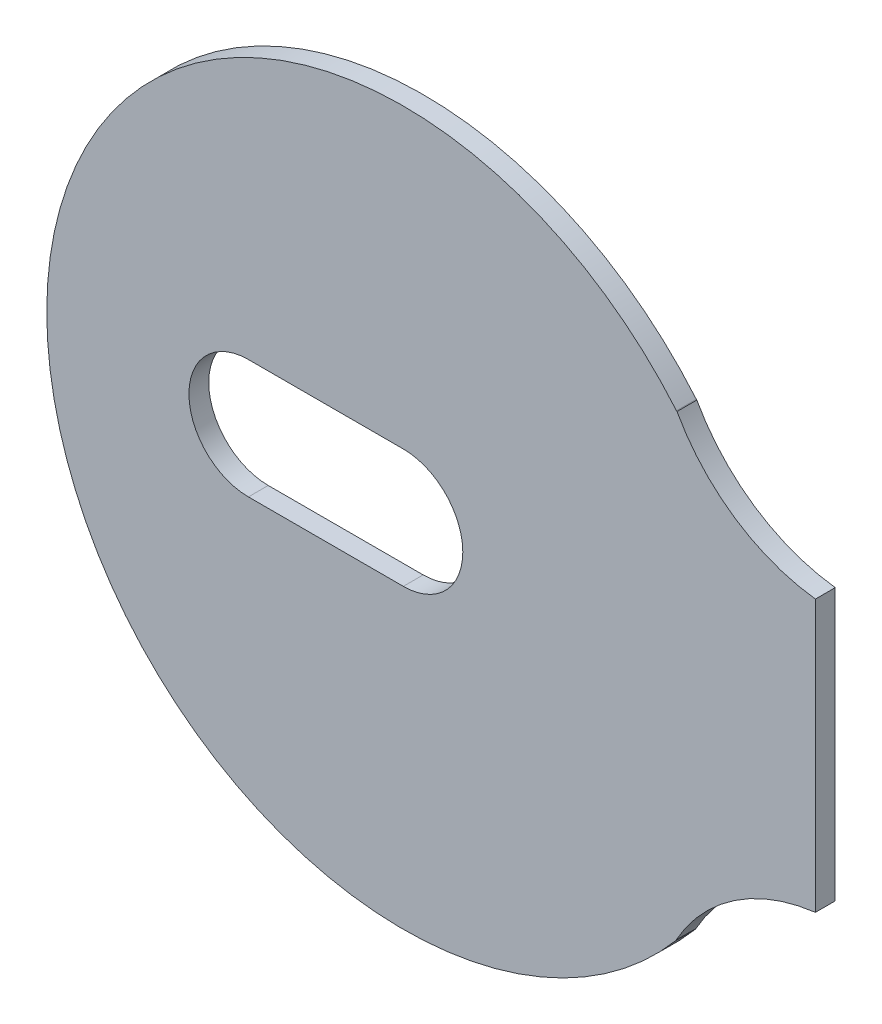
ISO-10303-21;
HEADER;
FILE_DESCRIPTION(('STEP AP214'),'2;1');
FILE_NAME('part.step','',(''),(''),'','','');
FILE_SCHEMA(('AUTOMOTIVE_DESIGN { 1 0 10303 214 1 1 1 1 }'));
ENDSEC;
DATA;
#1=APPLICATION_CONTEXT('core data for automotive mechanical design processes');
#2=APPLICATION_PROTOCOL_DEFINITION('international standard','automotive_design',2000,#1);
#3=PRODUCT_CONTEXT('',#1,'mechanical');
#4=PRODUCT('Part','Part','',(#3));
#5=PRODUCT_RELATED_PRODUCT_CATEGORY('part','',(#4));
#6=PRODUCT_DEFINITION_FORMATION('','',#4);
#7=PRODUCT_DEFINITION_CONTEXT('part definition',#1,'design');
#8=PRODUCT_DEFINITION('design','',#6,#7);
#9=PRODUCT_DEFINITION_SHAPE('','',#8);
#10=(LENGTH_UNIT() NAMED_UNIT(*) SI_UNIT(.MILLI.,.METRE.));
#11=(NAMED_UNIT(*) PLANE_ANGLE_UNIT() SI_UNIT($,.RADIAN.));
#12=(NAMED_UNIT(*) SI_UNIT($,.STERADIAN.) SOLID_ANGLE_UNIT());
#13=UNCERTAINTY_MEASURE_WITH_UNIT(LENGTH_MEASURE(1.E-05),#10,'distance_accuracy_value','');
#14=(GEOMETRIC_REPRESENTATION_CONTEXT(3) GLOBAL_UNCERTAINTY_ASSIGNED_CONTEXT((#13)) GLOBAL_UNIT_ASSIGNED_CONTEXT((#10,
#11,#12)) REPRESENTATION_CONTEXT('',''));
#15=CARTESIAN_POINT('',(0.,0.,0.));
#16=DIRECTION('',(0.,0.,1.));
#17=DIRECTION('',(1.,0.,0.));
#18=AXIS2_PLACEMENT_3D('',#15,#16,#17);
#19=CARTESIAN_POINT('',(-1.68641790286621E-06,1.48839274242687E-12,1.));
#20=DIRECTION('',(0.,0.,0.999999999999989));
#21=DIRECTION('',(0.999999999999995,0.,0.));
#22=AXIS2_PLACEMENT_3D('',#19,#20,#21);
#23=PLANE('',#22);
#24=CARTESIAN_POINT('',(-1.68641790286621E-06,1.48839274242687E-12,1.));
#25=DIRECTION('',(0.,0.,0.999999999999989));
#26=DIRECTION('',(0.999999999999995,0.,0.));
#27=AXIS2_PLACEMENT_3D('',#24,#25,#26);
#28=CIRCLE('',#27,17.9873368235399);
#29=CARTESIAN_POINT('',(13.7790977337644,11.562037241431,1.));
#30=VERTEX_POINT('',#29);
#31=CARTESIAN_POINT('',(13.756161336656,-11.5893168429399,1.));
#32=VERTEX_POINT('',#31);
#33=EDGE_CURVE('E149',#30,#32,#28,.T.);
#34=ORIENTED_EDGE('',*,*,#33,.T.);
#35=DIRECTION('',(-0.0323617704481932,0.999476220734364,0.));
#36=VECTOR('',#35,1.);
#37=CARTESIAN_POINT('',(13.756161336656,-11.5893168429399,1.));
#38=LINE('',#37,#36);
#39=CARTESIAN_POINT('',(13.75573772796,-11.5762339116699,1.));
#40=VERTEX_POINT('',#39);
#41=EDGE_CURVE('E152',#32,#40,#38,.T.);
#42=ORIENTED_EDGE('',*,*,#41,.T.);
#43=CARTESIAN_POINT('',(21.9238592590262,-16.1347771797835,0.999999999999997));
#44=DIRECTION('',(0.,0.,-0.999999999999989));
#45=DIRECTION('',(0.999999999999995,0.,0.));
#46=AXIS2_PLACEMENT_3D('',#43,#44,#45);
#47=CIRCLE('',#46,9.35406468191958);
#48=CARTESIAN_POINT('',(20.787340614677,-6.85001270002532,1.00000000000008));
#49=VERTEX_POINT('',#48);
#50=EDGE_CURVE('E155',#40,#49,#47,.T.);
#51=ORIENTED_EDGE('',*,*,#50,.T.);
#52=DIRECTION('',(0.,0.999999999999995,0.));
#53=VECTOR('',#52,1.);
#54=CARTESIAN_POINT('',(20.787340614677,-6.85001270002531,1.00000000000008));
#55=LINE('',#54,#53);
#56=CARTESIAN_POINT('',(20.787340614677,6.8387126087336,1.));
#57=VERTEX_POINT('',#56);
#58=EDGE_CURVE('E157',#49,#57,#55,.T.);
#59=ORIENTED_EDGE('',*,*,#58,.T.);
#60=CARTESIAN_POINT('',(21.8618680057291,15.9694738662407,1.));
#61=DIRECTION('',(0.,0.,-0.999999999999989));
#62=DIRECTION('',(0.999999999999995,0.,0.));
#63=AXIS2_PLACEMENT_3D('',#60,#61,#62);
#64=CIRCLE('',#63,9.19377018723637);
#65=CARTESIAN_POINT('',(13.8050997545794,11.540716071669,1.));
#66=VERTEX_POINT('',#65);
#67=EDGE_CURVE('E159',#57,#66,#64,.T.);
#68=ORIENTED_EDGE('',*,*,#67,.T.);
#69=DIRECTION('',(-0.777695902701099,0.628640662797045,0.));
#70=VECTOR('',#69,1.);
#71=CARTESIAN_POINT('',(13.8050997545794,11.540716071669,1.));
#72=LINE('',#71,#70);
#73=CARTESIAN_POINT('',(13.7808427652644,11.560323902683,1.));
#74=VERTEX_POINT('',#73);
#75=EDGE_CURVE('E161',#66,#74,#72,.T.);
#76=ORIENTED_EDGE('',*,*,#75,.T.);
#77=DIRECTION('',(-0.713556796547331,0.70059738659311,0.));
#78=VECTOR('',#77,1.);
#79=CARTESIAN_POINT('',(13.7808427652644,11.560323902683,1.));
#80=LINE('',#79,#78);
#81=EDGE_CURVE('E163',#74,#30,#80,.T.);
#82=ORIENTED_EDGE('',*,*,#81,.T.);
#83=EDGE_LOOP('',(#34,#42,#51,#59,#68,#76,#82));
#84=FACE_BOUND('',#83,.T.);
#85=DIRECTION('',(-0.999999999999995,0.,0.));
#86=VECTOR('',#85,1.);
#87=CARTESIAN_POINT('',(-7.81561595123188,3.00000508000998,1.));
#88=LINE('',#87,#86);
#89=CARTESIAN_POINT('',(0.,3.00000508000998,1.));
#90=VERTEX_POINT('',#89);
#91=CARTESIAN_POINT('',(-7.81561595123188,3.00000508000998,1.));
#92=VERTEX_POINT('',#91);
#93=EDGE_CURVE('E121',#90,#92,#88,.T.);
#94=ORIENTED_EDGE('',*,*,#93,.F.);
#95=CARTESIAN_POINT('',(1.76156528833079E-12,1.32521552325543E-08,1.));
#96=DIRECTION('',(0.,0.,0.999999999999989));
#97=DIRECTION('',(0.999999999999995,0.,0.));
#98=AXIS2_PLACEMENT_3D('',#95,#96,#97);
#99=CIRCLE('',#98,3.00000506675784);
#100=CARTESIAN_POINT('',(3.52313057666159E-12,-3.00000505350567,1.));
#101=VERTEX_POINT('',#100);
#102=EDGE_CURVE('E113',#101,#90,#99,.T.);
#103=ORIENTED_EDGE('',*,*,#102,.F.);
#104=DIRECTION('',(0.999999999999995,0.,0.));
#105=VECTOR('',#104,1.);
#106=CARTESIAN_POINT('',(3.52313057666159E-12,-3.00000505350567,1.));
#107=LINE('',#106,#105);
#108=CARTESIAN_POINT('',(-7.81561595122835,-3.00000505350567,1.));
#109=VERTEX_POINT('',#108);
#110=EDGE_CURVE('E135',#109,#101,#107,.T.);
#111=ORIENTED_EDGE('',*,*,#110,.F.);
#112=CARTESIAN_POINT('',(-7.81601473202711,1.32521550157138E-08,1.));
#113=DIRECTION('',(0.,0.,0.999999999999989));
#114=DIRECTION('',(0.999999999999995,0.,0.));
#115=AXIS2_PLACEMENT_3D('',#112,#113,#114);
#116=CIRCLE('',#115,3.00000509326215);
#117=EDGE_CURVE('E133',#92,#109,#116,.T.);
#118=ORIENTED_EDGE('',*,*,#117,.F.);
#119=EDGE_LOOP('',(#94,#103,#111,#118));
#120=FACE_BOUND('',#119,.T.);
#121=ADVANCED_FACE('F30',(#84,#120),#23,.T.);
#122=CARTESIAN_POINT('',(-1.68641790286621E-06,1.4883927423881E-12,0.));
#123=DIRECTION('',(0.,0.,0.999999999999989));
#124=DIRECTION('',(0.999999999999995,0.,0.));
#125=AXIS2_PLACEMENT_3D('',#122,#123,#124);
#126=PLANE('',#125);
#127=CARTESIAN_POINT('',(-1.68641790286621E-06,1.4883927423881E-12,0.));
#128=DIRECTION('',(0.,0.,0.999999999999989));
#129=DIRECTION('',(0.999999999999995,0.,0.));
#130=AXIS2_PLACEMENT_3D('',#127,#128,#129);
#131=CIRCLE('',#130,17.9873368235399);
#132=CARTESIAN_POINT('',(13.7790977337644,11.5620372414309,0.));
#133=VERTEX_POINT('',#132);
#134=CARTESIAN_POINT('',(13.7561613366559,-11.5893168429399,0.));
#135=VERTEX_POINT('',#134);
#136=EDGE_CURVE('E129',#133,#135,#131,.T.);
#137=ORIENTED_EDGE('',*,*,#136,.F.);
#138=DIRECTION('',(-0.713556796547331,0.70059738659311,0.));
#139=VECTOR('',#138,1.);
#140=CARTESIAN_POINT('',(13.7808427652644,11.5603239026829,0.));
#141=LINE('',#140,#139);
#142=CARTESIAN_POINT('',(13.7808427652644,11.5603239026829,0.));
#143=VERTEX_POINT('',#142);
#144=EDGE_CURVE('E153',#143,#133,#141,.T.);
#145=ORIENTED_EDGE('',*,*,#144,.F.);
#146=DIRECTION('',(-0.777695902701099,0.628640662797045,0.));
#147=VECTOR('',#146,1.);
#148=CARTESIAN_POINT('',(13.8050997545794,11.5407160716689,0.));
#149=LINE('',#148,#147);
#150=CARTESIAN_POINT('',(13.8050997545794,11.5407160716689,0.));
#151=VERTEX_POINT('',#150);
#152=EDGE_CURVE('E176',#151,#143,#149,.T.);
#153=ORIENTED_EDGE('',*,*,#152,.F.);
#154=CARTESIAN_POINT('',(21.8618680057291,15.9694738662407,0.));
#155=DIRECTION('',(0.,0.,-0.999999999999989));
#156=DIRECTION('',(0.999999999999995,0.,0.));
#157=AXIS2_PLACEMENT_3D('',#154,#155,#156);
#158=CIRCLE('',#157,9.19377018723637);
#159=CARTESIAN_POINT('',(20.787340614677,6.8387126087336,0.));
#160=VERTEX_POINT('',#159);
#161=EDGE_CURVE('E174',#160,#151,#158,.T.);
#162=ORIENTED_EDGE('',*,*,#161,.F.);
#163=DIRECTION('',(0.,0.999999999999995,0.));
#164=VECTOR('',#163,1.);
#165=CARTESIAN_POINT('',(20.787340614677,-6.85001270002531,0.));
#166=LINE('',#165,#164);
#167=CARTESIAN_POINT('',(20.787340614677,-6.85001270002532,0.));
#168=VERTEX_POINT('',#167);
#169=EDGE_CURVE('E172',#168,#160,#166,.T.);
#170=ORIENTED_EDGE('',*,*,#169,.F.);
#171=CARTESIAN_POINT('',(21.9238592590262,-16.1347771797835,0.));
#172=DIRECTION('',(0.,0.,-0.999999999999989));
#173=DIRECTION('',(0.999999999999995,0.,0.));
#174=AXIS2_PLACEMENT_3D('',#171,#172,#173);
#175=CIRCLE('',#174,9.35406468191958);
#176=CARTESIAN_POINT('',(13.7557377279599,-11.5762339116699,0.));
#177=VERTEX_POINT('',#176);
#178=EDGE_CURVE('E170',#177,#168,#175,.T.);
#179=ORIENTED_EDGE('',*,*,#178,.F.);
#180=DIRECTION('',(-0.0323617704481932,0.999476220734364,0.));
#181=VECTOR('',#180,1.);
#182=CARTESIAN_POINT('',(13.7561613366559,-11.5893168429399,0.));
#183=LINE('',#182,#181);
#184=EDGE_CURVE('E168',#135,#177,#183,.T.);
#185=ORIENTED_EDGE('',*,*,#184,.F.);
#186=EDGE_LOOP('',(#137,#145,#153,#162,#170,#179,#185));
#187=FACE_BOUND('',#186,.T.);
#188=CARTESIAN_POINT('',(1.7615652883308E-12,1.32521552325542E-08,0.));
#189=DIRECTION('',(0.,0.,0.999999999999989));
#190=DIRECTION('',(0.999999999999995,0.,0.));
#191=AXIS2_PLACEMENT_3D('',#188,#189,#190);
#192=CIRCLE('',#191,3.00000506675784);
#193=CARTESIAN_POINT('',(3.52313057376646E-12,-3.00000505350567,0.));
#194=VERTEX_POINT('',#193);
#195=CARTESIAN_POINT('',(0.,3.00000508000998,0.));
#196=VERTEX_POINT('',#195);
#197=EDGE_CURVE('E53',#194,#196,#192,.T.);
#198=ORIENTED_EDGE('',*,*,#197,.T.);
#199=DIRECTION('',(-0.999999999999995,0.,0.));
#200=VECTOR('',#199,1.);
#201=CARTESIAN_POINT('',(-7.81561595123192,3.00000508000998,0.));
#202=LINE('',#201,#200);
#203=CARTESIAN_POINT('',(-7.81561595123192,3.00000508000998,0.));
#204=VERTEX_POINT('',#203);
#205=EDGE_CURVE('E128',#196,#204,#202,.T.);
#206=ORIENTED_EDGE('',*,*,#205,.T.);
#207=CARTESIAN_POINT('',(-7.81601473202716,1.32521550157138E-08,0.));
#208=DIRECTION('',(0.,0.,0.999999999999989));
#209=DIRECTION('',(0.999999999999995,0.,0.));
#210=AXIS2_PLACEMENT_3D('',#207,#208,#209);
#211=CIRCLE('',#210,3.00000509326215);
#212=CARTESIAN_POINT('',(-7.81561595122839,-3.00000505350567,0.));
#213=VERTEX_POINT('',#212);
#214=EDGE_CURVE('E141',#204,#213,#211,.T.);
#215=ORIENTED_EDGE('',*,*,#214,.T.);
#216=DIRECTION('',(0.999999999999995,0.,0.));
#217=VECTOR('',#216,1.);
#218=CARTESIAN_POINT('',(3.52313057666159E-12,-3.00000505350567,0.));
#219=LINE('',#218,#217);
#220=EDGE_CURVE('E122',#213,#194,#219,.T.);
#221=ORIENTED_EDGE('',*,*,#220,.T.);
#222=EDGE_LOOP('',(#198,#206,#215,#221));
#223=FACE_BOUND('',#222,.T.);
#224=ADVANCED_FACE('F203',(#187,#223),#126,.F.);
#225=CARTESIAN_POINT('',(-1.68641790286621E-06,1.48839274242687E-12,1.));
#226=DIRECTION('',(0.,0.,-0.999999999999989));
#227=DIRECTION('',(-0.999999999999995,0.,0.));
#228=AXIS2_PLACEMENT_3D('',#225,#226,#227);
#229=CYLINDRICAL_SURFACE('',#228,17.9873368235399);
#230=ORIENTED_EDGE('',*,*,#136,.T.);
#231=DIRECTION('',(0.,0.,-0.999999999999989));
#232=VECTOR('',#231,1.);
#233=CARTESIAN_POINT('',(13.756161336656,-11.5893168429399,1.));
#234=LINE('',#233,#232);
#235=EDGE_CURVE('E11',#32,#135,#234,.T.);
#236=ORIENTED_EDGE('',*,*,#235,.F.);
#237=ORIENTED_EDGE('',*,*,#33,.F.);
#238=DIRECTION('',(0.,0.,-0.999999999999989));
#239=VECTOR('',#238,1.);
#240=CARTESIAN_POINT('',(13.7790977337644,11.562037241431,1.));
#241=LINE('',#240,#239);
#242=EDGE_CURVE('E165',#30,#133,#241,.T.);
#243=ORIENTED_EDGE('',*,*,#242,.T.);
#244=EDGE_LOOP('',(#230,#236,#237,#243));
#245=FACE_BOUND('',#244,.T.);
#246=ADVANCED_FACE('F32',(#245),#229,.T.);
#247=CARTESIAN_POINT('',(13.756161336656,-11.5893168429399,1.));
#248=DIRECTION('',(-0.999476220734364,-0.0323617704481932,0.));
#249=DIRECTION('',(0.0323617704481932,-0.999476220734364,0.));
#250=AXIS2_PLACEMENT_3D('',#247,#248,#249);
#251=PLANE('',#250);
#252=ORIENTED_EDGE('',*,*,#184,.T.);
#253=DIRECTION('',(0.,0.,-0.999999999999989));
#254=VECTOR('',#253,1.);
#255=CARTESIAN_POINT('',(13.75573772796,-11.5762339116699,1.));
#256=LINE('',#255,#254);
#257=EDGE_CURVE('E38',#40,#177,#256,.T.);
#258=ORIENTED_EDGE('',*,*,#257,.F.);
#259=ORIENTED_EDGE('',*,*,#41,.F.);
#260=ORIENTED_EDGE('',*,*,#235,.T.);
#261=EDGE_LOOP('',(#252,#258,#259,#260));
#262=FACE_BOUND('',#261,.T.);
#263=ADVANCED_FACE('F220',(#262),#251,.F.);
#264=CARTESIAN_POINT('',(21.9238592590262,-16.1347771797835,0.999999999999997));
#265=DIRECTION('',(0.,0.,-0.999999999999989));
#266=DIRECTION('',(-0.999999999999995,0.,0.));
#267=AXIS2_PLACEMENT_3D('',#264,#265,#266);
#268=CYLINDRICAL_SURFACE('',#267,9.35406468191958);
#269=ORIENTED_EDGE('',*,*,#178,.T.);
#270=DIRECTION('',(0.,0.,-0.999999999999989));
#271=VECTOR('',#270,1.);
#272=CARTESIAN_POINT('',(20.787340614677,-6.85001270002532,1.00000000000008));
#273=LINE('',#272,#271);
#274=EDGE_CURVE('E190',#49,#168,#273,.T.);
#275=ORIENTED_EDGE('',*,*,#274,.F.);
#276=ORIENTED_EDGE('',*,*,#50,.F.);
#277=ORIENTED_EDGE('',*,*,#257,.T.);
#278=EDGE_LOOP('',(#269,#275,#276,#277));
#279=FACE_BOUND('',#278,.T.);
#280=ADVANCED_FACE('F197',(#279),#268,.F.);
#281=CARTESIAN_POINT('',(20.787340614677,-6.85001270002531,1.00000000000008));
#282=DIRECTION('',(-0.999999999999995,0.,0.));
#283=DIRECTION('',(0.,0.,0.999999999999989));
#284=AXIS2_PLACEMENT_3D('',#281,#282,#283);
#285=PLANE('',#284);
#286=ORIENTED_EDGE('',*,*,#169,.T.);
#287=DIRECTION('',(0.,0.,-0.999999999999989));
#288=VECTOR('',#287,1.);
#289=CARTESIAN_POINT('',(20.787340614677,6.8387126087336,1.));
#290=LINE('',#289,#288);
#291=EDGE_CURVE('E187',#57,#160,#290,.T.);
#292=ORIENTED_EDGE('',*,*,#291,.F.);
#293=ORIENTED_EDGE('',*,*,#58,.F.);
#294=ORIENTED_EDGE('',*,*,#274,.T.);
#295=EDGE_LOOP('',(#286,#292,#293,#294));
#296=FACE_BOUND('',#295,.T.);
#297=ADVANCED_FACE('F209',(#296),#285,.F.);
#298=CARTESIAN_POINT('',(21.8618680057291,15.9694738662407,1.));
#299=DIRECTION('',(0.,0.,-0.999999999999989));
#300=DIRECTION('',(-0.999999999999995,0.,0.));
#301=AXIS2_PLACEMENT_3D('',#298,#299,#300);
#302=CYLINDRICAL_SURFACE('',#301,9.19377018723637);
#303=ORIENTED_EDGE('',*,*,#161,.T.);
#304=DIRECTION('',(0.,0.,-0.999999999999989));
#305=VECTOR('',#304,1.);
#306=CARTESIAN_POINT('',(13.8050997545794,11.540716071669,1.));
#307=LINE('',#306,#305);
#308=EDGE_CURVE('E184',#66,#151,#307,.T.);
#309=ORIENTED_EDGE('',*,*,#308,.F.);
#310=ORIENTED_EDGE('',*,*,#67,.F.);
#311=ORIENTED_EDGE('',*,*,#291,.T.);
#312=EDGE_LOOP('',(#303,#309,#310,#311));
#313=FACE_BOUND('',#312,.T.);
#314=ADVANCED_FACE('F213',(#313),#302,.F.);
#315=CARTESIAN_POINT('',(13.8050997545794,11.540716071669,1.));
#316=DIRECTION('',(-0.628640662797045,-0.777695902701099,0.));
#317=DIRECTION('',(0.777695902701099,-0.628640662797045,0.));
#318=AXIS2_PLACEMENT_3D('',#315,#316,#317);
#319=PLANE('',#318);
#320=ORIENTED_EDGE('',*,*,#152,.T.);
#321=DIRECTION('',(0.,0.,-0.999999999999989));
#322=VECTOR('',#321,1.);
#323=CARTESIAN_POINT('',(13.7808427652644,11.560323902683,1.));
#324=LINE('',#323,#322);
#325=EDGE_CURVE('E181',#74,#143,#324,.T.);
#326=ORIENTED_EDGE('',*,*,#325,.F.);
#327=ORIENTED_EDGE('',*,*,#75,.F.);
#328=ORIENTED_EDGE('',*,*,#308,.T.);
#329=EDGE_LOOP('',(#320,#326,#327,#328));
#330=FACE_BOUND('',#329,.T.);
#331=ADVANCED_FACE('F228',(#330),#319,.F.);
#332=CARTESIAN_POINT('',(13.7808427652644,11.560323902683,1.));
#333=DIRECTION('',(-0.70059738659311,-0.713556796547331,0.));
#334=DIRECTION('',(0.713556796547331,-0.70059738659311,0.));
#335=AXIS2_PLACEMENT_3D('',#332,#333,#334);
#336=PLANE('',#335);
#337=ORIENTED_EDGE('',*,*,#144,.T.);
#338=ORIENTED_EDGE('',*,*,#242,.F.);
#339=ORIENTED_EDGE('',*,*,#81,.F.);
#340=ORIENTED_EDGE('',*,*,#325,.T.);
#341=EDGE_LOOP('',(#337,#338,#339,#340));
#342=FACE_BOUND('',#341,.T.);
#343=ADVANCED_FACE('F225',(#342),#336,.F.);
#344=CARTESIAN_POINT('',(1.76156528833079E-12,1.32521552325543E-08,1.));
#345=DIRECTION('',(0.,0.,-0.999999999999989));
#346=DIRECTION('',(-0.999999999999995,0.,0.));
#347=AXIS2_PLACEMENT_3D('',#344,#345,#346);
#348=CYLINDRICAL_SURFACE('',#347,3.00000506675784);
#349=ORIENTED_EDGE('',*,*,#197,.F.);
#350=DIRECTION('',(0.,0.,-0.999999999999989));
#351=VECTOR('',#350,1.);
#352=CARTESIAN_POINT('',(3.52313057666159E-12,-3.00000505350567,1.));
#353=LINE('',#352,#351);
#354=EDGE_CURVE('E117',#101,#194,#353,.T.);
#355=ORIENTED_EDGE('',*,*,#354,.F.);
#356=ORIENTED_EDGE('',*,*,#102,.T.);
#357=DIRECTION('',(0.,0.,-0.999999999999989));
#358=VECTOR('',#357,1.);
#359=CARTESIAN_POINT('',(0.,3.00000508000998,1.));
#360=LINE('',#359,#358);
#361=EDGE_CURVE('E116',#90,#196,#360,.T.);
#362=ORIENTED_EDGE('',*,*,#361,.T.);
#363=EDGE_LOOP('',(#349,#355,#356,#362));
#364=FACE_BOUND('',#363,.T.);
#365=ADVANCED_FACE('F115',(#364),#348,.F.);
#366=CARTESIAN_POINT('',(-7.81561595123188,3.00000508000998,1.));
#367=DIRECTION('',(0.,-0.999999999999995,0.));
#368=DIRECTION('',(0.,0.,-0.999999999999989));
#369=AXIS2_PLACEMENT_3D('',#366,#367,#368);
#370=PLANE('',#369);
#371=ORIENTED_EDGE('',*,*,#205,.F.);
#372=ORIENTED_EDGE('',*,*,#361,.F.);
#373=ORIENTED_EDGE('',*,*,#93,.T.);
#374=DIRECTION('',(0.,0.,-0.999999999999989));
#375=VECTOR('',#374,1.);
#376=CARTESIAN_POINT('',(-7.81561595123188,3.00000508000998,1.));
#377=LINE('',#376,#375);
#378=EDGE_CURVE('E130',#92,#204,#377,.T.);
#379=ORIENTED_EDGE('',*,*,#378,.T.);
#380=EDGE_LOOP('',(#371,#372,#373,#379));
#381=FACE_BOUND('',#380,.T.);
#382=ADVANCED_FACE('F125',(#381),#370,.T.);
#383=CARTESIAN_POINT('',(-7.81601473202711,1.32521550157138E-08,1.));
#384=DIRECTION('',(0.,0.,-0.999999999999989));
#385=DIRECTION('',(-0.999999999999995,0.,0.));
#386=AXIS2_PLACEMENT_3D('',#383,#384,#385);
#387=CYLINDRICAL_SURFACE('',#386,3.00000509326215);
#388=ORIENTED_EDGE('',*,*,#214,.F.);
#389=ORIENTED_EDGE('',*,*,#378,.F.);
#390=ORIENTED_EDGE('',*,*,#117,.T.);
#391=DIRECTION('',(0.,0.,-0.999999999999989));
#392=VECTOR('',#391,1.);
#393=CARTESIAN_POINT('',(-7.81561595122835,-3.00000505350567,1.));
#394=LINE('',#393,#392);
#395=EDGE_CURVE('E45',#109,#213,#394,.T.);
#396=ORIENTED_EDGE('',*,*,#395,.T.);
#397=EDGE_LOOP('',(#388,#389,#390,#396));
#398=FACE_BOUND('',#397,.T.);
#399=ADVANCED_FACE('F248',(#398),#387,.F.);
#400=CARTESIAN_POINT('',(3.52313057666159E-12,-3.00000505350567,1.));
#401=DIRECTION('',(0.,0.999999999999995,0.));
#402=DIRECTION('',(0.,0.,0.999999999999989));
#403=AXIS2_PLACEMENT_3D('',#400,#401,#402);
#404=PLANE('',#403);
#405=ORIENTED_EDGE('',*,*,#220,.F.);
#406=ORIENTED_EDGE('',*,*,#395,.F.);
#407=ORIENTED_EDGE('',*,*,#110,.T.);
#408=ORIENTED_EDGE('',*,*,#354,.T.);
#409=EDGE_LOOP('',(#405,#406,#407,#408));
#410=FACE_BOUND('',#409,.T.);
#411=ADVANCED_FACE('F251',(#410),#404,.T.);
#412=CLOSED_SHELL('',(#121,#224,#246,#263,#280,#297,#314,#331,#343,#365,#382,#399,#411));
#413=MANIFOLD_SOLID_BREP('B2',#412);
#414=ADVANCED_BREP_SHAPE_REPRESENTATION('',(#18,#413),#14);
#415=SHAPE_DEFINITION_REPRESENTATION(#9,#414);
ENDSEC;
END-ISO-10303-21;
